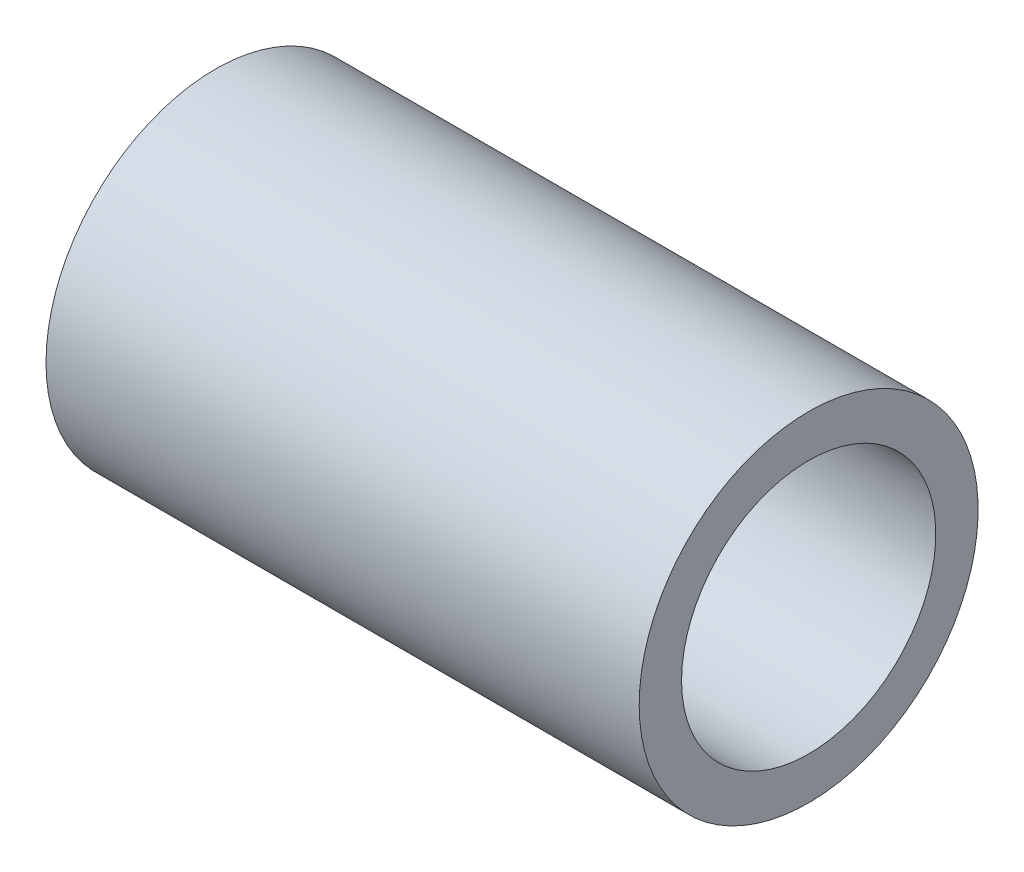
ISO-10303-21;
HEADER;
FILE_DESCRIPTION(('STEP AP214'),'2;1');
FILE_NAME('part.step','',(''),(''),'','','');
FILE_SCHEMA(('AUTOMOTIVE_DESIGN { 1 0 10303 214 1 1 1 1 }'));
ENDSEC;
DATA;
#1=APPLICATION_CONTEXT('core data for automotive mechanical design processes');
#2=APPLICATION_PROTOCOL_DEFINITION('international standard','automotive_design',2000,#1);
#3=PRODUCT_CONTEXT('',#1,'mechanical');
#4=PRODUCT('Part','Part','',(#3));
#5=PRODUCT_RELATED_PRODUCT_CATEGORY('part','',(#4));
#6=PRODUCT_DEFINITION_FORMATION('','',#4);
#7=PRODUCT_DEFINITION_CONTEXT('part definition',#1,'design');
#8=PRODUCT_DEFINITION('design','',#6,#7);
#9=PRODUCT_DEFINITION_SHAPE('','',#8);
#10=(LENGTH_UNIT() NAMED_UNIT(*) SI_UNIT(.MILLI.,.METRE.));
#11=(NAMED_UNIT(*) PLANE_ANGLE_UNIT() SI_UNIT($,.RADIAN.));
#12=(NAMED_UNIT(*) SI_UNIT($,.STERADIAN.) SOLID_ANGLE_UNIT());
#13=UNCERTAINTY_MEASURE_WITH_UNIT(LENGTH_MEASURE(1.E-05),#10,'distance_accuracy_value','');
#14=(GEOMETRIC_REPRESENTATION_CONTEXT(3) GLOBAL_UNCERTAINTY_ASSIGNED_CONTEXT((#13)) GLOBAL_UNIT_ASSIGNED_CONTEXT((#10,
#11,#12)) REPRESENTATION_CONTEXT('',''));
#15=CARTESIAN_POINT('',(0.,0.,0.));
#16=DIRECTION('',(0.,0.,1.));
#17=DIRECTION('',(1.,0.,0.));
#18=AXIS2_PLACEMENT_3D('',#15,#16,#17);
#19=CARTESIAN_POINT('',(-3.5,2.,0.));
#20=DIRECTION('',(1.,0.,0.));
#21=DIRECTION('',(0.,0.,-1.));
#22=AXIS2_PLACEMENT_3D('',#19,#20,#21);
#23=PLANE('',#22);
#24=CARTESIAN_POINT('',(-3.5,0.,0.));
#25=DIRECTION('',(-1.,0.,0.));
#26=DIRECTION('',(0.,0.,1.));
#27=AXIS2_PLACEMENT_3D('',#24,#25,#26);
#28=CIRCLE('',#27,1.5);
#29=CARTESIAN_POINT('',(-3.5,0.,1.5));
#30=VERTEX_POINT('',#29);
#31=EDGE_CURVE('E10',#30,#30,#28,.T.);
#32=ORIENTED_EDGE('',*,*,#31,.F.);
#33=EDGE_LOOP('',(#32));
#34=FACE_BOUND('',#33,.T.);
#35=CARTESIAN_POINT('',(-3.5,0.,0.));
#36=DIRECTION('',(-1.,0.,0.));
#37=DIRECTION('',(0.,0.,1.));
#38=AXIS2_PLACEMENT_3D('',#35,#36,#37);
#39=CIRCLE('',#38,2.);
#40=CARTESIAN_POINT('',(-3.5,0.,2.));
#41=VERTEX_POINT('',#40);
#42=EDGE_CURVE('E46',#41,#41,#39,.T.);
#43=ORIENTED_EDGE('',*,*,#42,.T.);
#44=EDGE_LOOP('',(#43));
#45=FACE_BOUND('',#44,.T.);
#46=ADVANCED_FACE('F32',(#34,#45),#23,.F.);
#47=CARTESIAN_POINT('',(-0.962623157134353,0.,0.));
#48=DIRECTION('',(-1.,0.,0.));
#49=DIRECTION('',(0.,0.,1.));
#50=AXIS2_PLACEMENT_3D('',#47,#48,#49);
#51=CYLINDRICAL_SURFACE('',#50,1.5);
#52=CARTESIAN_POINT('',(3.5,0.,0.));
#53=DIRECTION('',(-1.,0.,0.));
#54=DIRECTION('',(0.,0.,1.));
#55=AXIS2_PLACEMENT_3D('',#52,#53,#54);
#56=CIRCLE('',#55,1.5);
#57=CARTESIAN_POINT('',(3.5,0.,1.5));
#58=VERTEX_POINT('',#57);
#59=EDGE_CURVE('E38',#58,#58,#56,.T.);
#60=ORIENTED_EDGE('',*,*,#59,.F.);
#61=EDGE_LOOP('',(#60));
#62=FACE_BOUND('',#61,.T.);
#63=ORIENTED_EDGE('',*,*,#31,.T.);
#64=EDGE_LOOP('',(#63));
#65=FACE_BOUND('',#64,.T.);
#66=ADVANCED_FACE('F61',(#62,#65),#51,.F.);
#67=CARTESIAN_POINT('',(3.5,2.,0.));
#68=DIRECTION('',(-1.,0.,0.));
#69=DIRECTION('',(0.,0.,1.));
#70=AXIS2_PLACEMENT_3D('',#67,#68,#69);
#71=PLANE('',#70);
#72=CARTESIAN_POINT('',(3.5,0.,0.));
#73=DIRECTION('',(-1.,0.,0.));
#74=DIRECTION('',(0.,0.,1.));
#75=AXIS2_PLACEMENT_3D('',#72,#73,#74);
#76=CIRCLE('',#75,2.);
#77=CARTESIAN_POINT('',(3.5,0.,2.));
#78=VERTEX_POINT('',#77);
#79=EDGE_CURVE('E42',#78,#78,#76,.T.);
#80=ORIENTED_EDGE('',*,*,#79,.F.);
#81=EDGE_LOOP('',(#80));
#82=FACE_BOUND('',#81,.T.);
#83=ORIENTED_EDGE('',*,*,#59,.T.);
#84=EDGE_LOOP('',(#83));
#85=FACE_BOUND('',#84,.T.);
#86=ADVANCED_FACE('F56',(#82,#85),#71,.F.);
#87=CARTESIAN_POINT('',(-0.962623157134353,0.,0.));
#88=DIRECTION('',(-1.,0.,0.));
#89=DIRECTION('',(0.,0.,1.));
#90=AXIS2_PLACEMENT_3D('',#87,#88,#89);
#91=CYLINDRICAL_SURFACE('',#90,2.);
#92=ORIENTED_EDGE('',*,*,#42,.F.);
#93=EDGE_LOOP('',(#92));
#94=FACE_BOUND('',#93,.T.);
#95=ORIENTED_EDGE('',*,*,#79,.T.);
#96=EDGE_LOOP('',(#95));
#97=FACE_BOUND('',#96,.T.);
#98=ADVANCED_FACE('F53',(#94,#97),#91,.T.);
#99=CLOSED_SHELL('',(#46,#66,#86,#98));
#100=MANIFOLD_SOLID_BREP('B2',#99);
#101=ADVANCED_BREP_SHAPE_REPRESENTATION('',(#18,#100),#14);
#102=SHAPE_DEFINITION_REPRESENTATION(#9,#101);
ENDSEC;
END-ISO-10303-21;
